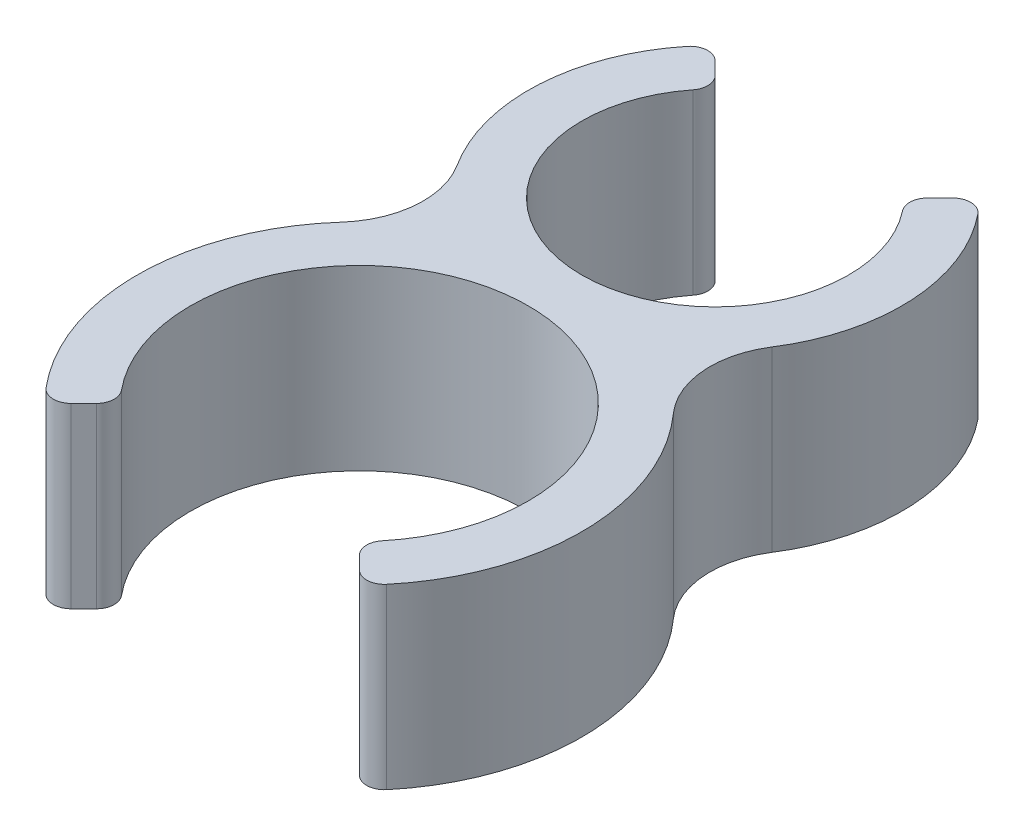
ISO-10303-21;
HEADER;
FILE_DESCRIPTION(('STEP AP214'),'2;1');
FILE_NAME('part.step','',(''),(''),'','','');
FILE_SCHEMA(('AUTOMOTIVE_DESIGN { 1 0 10303 214 1 1 1 1 }'));
ENDSEC;
DATA;
#1=APPLICATION_CONTEXT('core data for automotive mechanical design processes');
#2=APPLICATION_PROTOCOL_DEFINITION('international standard','automotive_design',2000,#1);
#3=PRODUCT_CONTEXT('',#1,'mechanical');
#4=PRODUCT('Part','Part','',(#3));
#5=PRODUCT_RELATED_PRODUCT_CATEGORY('part','',(#4));
#6=PRODUCT_DEFINITION_FORMATION('','',#4);
#7=PRODUCT_DEFINITION_CONTEXT('part definition',#1,'design');
#8=PRODUCT_DEFINITION('design','',#6,#7);
#9=PRODUCT_DEFINITION_SHAPE('','',#8);
#10=(LENGTH_UNIT() NAMED_UNIT(*) SI_UNIT(.MILLI.,.METRE.));
#11=(NAMED_UNIT(*) PLANE_ANGLE_UNIT() SI_UNIT($,.RADIAN.));
#12=(NAMED_UNIT(*) SI_UNIT($,.STERADIAN.) SOLID_ANGLE_UNIT());
#13=UNCERTAINTY_MEASURE_WITH_UNIT(LENGTH_MEASURE(1.E-05),#10,'distance_accuracy_value','');
#14=(GEOMETRIC_REPRESENTATION_CONTEXT(3) GLOBAL_UNCERTAINTY_ASSIGNED_CONTEXT((#13)) GLOBAL_UNIT_ASSIGNED_CONTEXT((#10,
#11,#12)) REPRESENTATION_CONTEXT('',''));
#15=CARTESIAN_POINT('',(0.,0.,0.));
#16=DIRECTION('',(0.,0.,1.));
#17=DIRECTION('',(1.,0.,0.));
#18=AXIS2_PLACEMENT_3D('',#15,#16,#17);
#19=CARTESIAN_POINT('',(0.,10.,-10.));
#20=DIRECTION('',(0.,-1.,0.));
#21=DIRECTION('',(0.,0.,-1.));
#22=AXIS2_PLACEMENT_3D('',#19,#20,#21);
#23=CYLINDRICAL_SURFACE('',#22,7.5);
#24=CARTESIAN_POINT('',(0.,0.,-10.));
#25=DIRECTION('',(0.,-1.,0.));
#26=DIRECTION('',(0.,0.,1.));
#27=AXIS2_PLACEMENT_3D('',#24,#25,#26);
#28=CIRCLE('',#27,7.5);
#29=CARTESIAN_POINT('',(5.89038968324402,0.,-14.6425541870324));
#30=VERTEX_POINT('',#29);
#31=CARTESIAN_POINT('',(-5.89038968324402,0.,-14.6425541870324));
#32=VERTEX_POINT('',#31);
#33=EDGE_CURVE('E378',#30,#32,#28,.T.);
#34=ORIENTED_EDGE('',*,*,#33,.T.);
#35=DIRECTION('',(0.,-1.,0.));
#36=VECTOR('',#35,1.);
#37=CARTESIAN_POINT('',(-5.89038968324402,10.,-14.6425541870324));
#38=LINE('',#37,#36);
#39=CARTESIAN_POINT('',(-5.89038968324402,10.,-14.6425541870324));
#40=VERTEX_POINT('',#39);
#41=EDGE_CURVE('E262',#32,#40,#38,.F.);
#42=ORIENTED_EDGE('',*,*,#41,.T.);
#43=CARTESIAN_POINT('',(0.,10.,-10.));
#44=DIRECTION('',(0.,-1.,0.));
#45=DIRECTION('',(0.,0.,1.));
#46=AXIS2_PLACEMENT_3D('',#43,#44,#45);
#47=CIRCLE('',#46,7.5);
#48=CARTESIAN_POINT('',(5.89038968324402,10.,-14.6425541870324));
#49=VERTEX_POINT('',#48);
#50=EDGE_CURVE('E206',#49,#40,#47,.T.);
#51=ORIENTED_EDGE('',*,*,#50,.F.);
#52=DIRECTION('',(0.,-1.,0.));
#53=VECTOR('',#52,1.);
#54=CARTESIAN_POINT('',(5.89038968324402,10.,-14.6425541870324));
#55=LINE('',#54,#53);
#56=EDGE_CURVE('E259',#49,#30,#55,.T.);
#57=ORIENTED_EDGE('',*,*,#56,.T.);
#58=EDGE_LOOP('',(#34,#42,#51,#57));
#59=FACE_BOUND('',#58,.T.);
#60=ADVANCED_FACE('F33',(#59),#23,.F.);
#61=CARTESIAN_POINT('',(-5.30330085889912,10.,-15.3033008588991));
#62=DIRECTION('',(-0.707106781186546,0.,0.707106781186549));
#63=DIRECTION('',(0.707106781186549,0.,0.707106781186546));
#64=AXIS2_PLACEMENT_3D('',#61,#62,#63);
#65=PLANE('',#64);
#66=DIRECTION('',(-0.707106781186549,0.,-0.707106781186546));
#67=VECTOR('',#66,1.);
#68=CARTESIAN_POINT('',(-5.30330085889912,10.,-15.3033008588991));
#69=LINE('',#68,#67);
#70=CARTESIAN_POINT('',(-5.96866819315668,10.,-15.9686681931567));
#71=VERTEX_POINT('',#70);
#72=CARTESIAN_POINT('',(-6.68019460794371,10.,-16.6801946079437));
#73=VERTEX_POINT('',#72);
#74=EDGE_CURVE('E359',#71,#73,#69,.T.);
#75=ORIENTED_EDGE('',*,*,#74,.F.);
#76=DIRECTION('',(0.,-1.,0.));
#77=VECTOR('',#76,1.);
#78=CARTESIAN_POINT('',(-5.96866819315668,10.,-15.9686681931567));
#79=LINE('',#78,#77);
#80=CARTESIAN_POINT('',(-5.96866819315668,0.,-15.9686681931567));
#81=VERTEX_POINT('',#80);
#82=EDGE_CURVE('E256',#71,#81,#79,.T.);
#83=ORIENTED_EDGE('',*,*,#82,.T.);
#84=DIRECTION('',(-0.707106781186549,0.,-0.707106781186546));
#85=VECTOR('',#84,1.);
#86=CARTESIAN_POINT('',(-5.30330085889912,0.,-15.3033008588991));
#87=LINE('',#86,#85);
#88=CARTESIAN_POINT('',(-6.68019460794371,0.,-16.6801946079437));
#89=VERTEX_POINT('',#88);
#90=EDGE_CURVE('E380',#81,#89,#87,.T.);
#91=ORIENTED_EDGE('',*,*,#90,.T.);
#92=DIRECTION('',(0.,-1.,0.));
#93=VECTOR('',#92,1.);
#94=CARTESIAN_POINT('',(-6.68019460794371,10.,-16.6801946079437));
#95=LINE('',#94,#93);
#96=EDGE_CURVE('E254',#89,#73,#95,.F.);
#97=ORIENTED_EDGE('',*,*,#96,.T.);
#98=EDGE_LOOP('',(#75,#83,#91,#97));
#99=FACE_BOUND('',#98,.T.);
#100=ADVANCED_FACE('F311',(#99),#65,.F.);
#101=CARTESIAN_POINT('',(0.,10.,-10.));
#102=DIRECTION('',(0.,-1.,0.));
#103=DIRECTION('',(0.,0.,-1.));
#104=AXIS2_PLACEMENT_3D('',#101,#102,#103);
#105=CYLINDRICAL_SURFACE('',#104,10.5);
#106=CARTESIAN_POINT('',(0.,0.,-10.));
#107=DIRECTION('',(0.,1.,0.));
#108=DIRECTION('',(0.,0.,1.));
#109=AXIS2_PLACEMENT_3D('',#106,#107,#108);
#110=CIRCLE('',#109,10.5);
#111=CARTESIAN_POINT('',(-8.16491206167028,0.,-16.6018339137842));
#112=VERTEX_POINT('',#111);
#113=CARTESIAN_POINT('',(-8.84616047508096,0.,-4.34354838709677));
#114=VERTEX_POINT('',#113);
#115=EDGE_CURVE('E383',#112,#114,#110,.T.);
#116=ORIENTED_EDGE('',*,*,#115,.T.);
#117=DIRECTION('',(0.,-1.,0.));
#118=VECTOR('',#117,1.);
#119=CARTESIAN_POINT('',(-8.84616047508096,10.,-4.34354838709677));
#120=LINE('',#119,#118);
#121=CARTESIAN_POINT('',(-8.84616047508096,10.,-4.34354838709677));
#122=VERTEX_POINT('',#121);
#123=EDGE_CURVE('E54',#114,#122,#120,.F.);
#124=ORIENTED_EDGE('',*,*,#123,.T.);
#125=CARTESIAN_POINT('',(0.,10.,-10.));
#126=DIRECTION('',(0.,1.,0.));
#127=DIRECTION('',(0.,0.,1.));
#128=AXIS2_PLACEMENT_3D('',#125,#126,#127);
#129=CIRCLE('',#128,10.5);
#130=CARTESIAN_POINT('',(-8.16491206167028,10.,-16.6018339137842));
#131=VERTEX_POINT('',#130);
#132=EDGE_CURVE('E362',#131,#122,#129,.T.);
#133=ORIENTED_EDGE('',*,*,#132,.F.);
#134=DIRECTION('',(0.,-1.,0.));
#135=VECTOR('',#134,1.);
#136=CARTESIAN_POINT('',(-8.16491206167028,10.,-16.6018339137842));
#137=LINE('',#136,#135);
#138=EDGE_CURVE('E272',#131,#112,#137,.T.);
#139=ORIENTED_EDGE('',*,*,#138,.T.);
#140=EDGE_LOOP('',(#116,#124,#133,#139));
#141=FACE_BOUND('',#140,.T.);
#142=ADVANCED_FACE('F317',(#141),#105,.T.);
#143=CARTESIAN_POINT('',(0.,10.,10.));
#144=DIRECTION('',(0.,-1.,0.));
#145=DIRECTION('',(0.,0.,-1.));
#146=AXIS2_PLACEMENT_3D('',#143,#144,#145);
#147=CYLINDRICAL_SURFACE('',#146,12.5);
#148=CARTESIAN_POINT('',(0.,10.,10.));
#149=DIRECTION('',(0.,1.,0.));
#150=DIRECTION('',(0.,0.,1.));
#151=AXIS2_PLACEMENT_3D('',#148,#149,#150);
#152=CIRCLE('',#151,12.5);
#153=CARTESIAN_POINT('',(-9.32758417440509,10.,1.67857142857143));
#154=VERTEX_POINT('',#153);
#155=CARTESIAN_POINT('',(-9.57394853716998,10.,18.0367598824166));
#156=VERTEX_POINT('',#155);
#157=EDGE_CURVE('E366',#154,#156,#152,.T.);
#158=ORIENTED_EDGE('',*,*,#157,.F.);
#159=DIRECTION('',(0.,-1.,0.));
#160=VECTOR('',#159,1.);
#161=CARTESIAN_POINT('',(-9.32758417440509,10.,1.67857142857143));
#162=LINE('',#161,#160);
#163=CARTESIAN_POINT('',(-9.32758417440509,0.,1.67857142857143));
#164=VERTEX_POINT('',#163);
#165=EDGE_CURVE('E280',#154,#164,#162,.T.);
#166=ORIENTED_EDGE('',*,*,#165,.T.);
#167=CARTESIAN_POINT('',(0.,0.,10.));
#168=DIRECTION('',(0.,1.,0.));
#169=DIRECTION('',(0.,0.,1.));
#170=AXIS2_PLACEMENT_3D('',#167,#168,#169);
#171=CIRCLE('',#170,12.5);
#172=CARTESIAN_POINT('',(-9.57394853716998,0.,18.0367598824166));
#173=VERTEX_POINT('',#172);
#174=EDGE_CURVE('E385',#164,#173,#171,.T.);
#175=ORIENTED_EDGE('',*,*,#174,.T.);
#176=DIRECTION('',(0.,-1.,0.));
#177=VECTOR('',#176,1.);
#178=CARTESIAN_POINT('',(-9.57394853716998,10.,18.0367598824166));
#179=LINE('',#178,#177);
#180=EDGE_CURVE('E251',#173,#156,#179,.F.);
#181=ORIENTED_EDGE('',*,*,#180,.T.);
#182=EDGE_LOOP('',(#158,#166,#175,#181));
#183=FACE_BOUND('',#182,.T.);
#184=ADVANCED_FACE('F414',(#183),#147,.T.);
#185=CARTESIAN_POINT('',(-6.71751442127221,10.,16.7175144212722));
#186=DIRECTION('',(-0.707106781186545,0.,-0.70710678118655));
#187=DIRECTION('',(-0.70710678118655,0.,0.707106781186545));
#188=AXIS2_PLACEMENT_3D('',#185,#186,#187);
#189=PLANE('',#188);
#190=DIRECTION('',(0.70710678118655,0.,-0.707106781186545));
#191=VECTOR('',#190,1.);
#192=CARTESIAN_POINT('',(-6.71751442127221,10.,16.7175144212722));
#193=LINE('',#192,#191);
#194=CARTESIAN_POINT('',(-8.10092587300984,10.,18.1009258730098));
#195=VERTEX_POINT('',#194);
#196=CARTESIAN_POINT('',(-7.39087274954725,10.,17.3908727495472));
#197=VERTEX_POINT('',#196);
#198=EDGE_CURVE('E368',#195,#197,#193,.T.);
#199=ORIENTED_EDGE('',*,*,#198,.F.);
#200=DIRECTION('',(0.,-1.,0.));
#201=VECTOR('',#200,1.);
#202=CARTESIAN_POINT('',(-8.10092587300984,10.,18.1009258730098));
#203=LINE('',#202,#201);
#204=CARTESIAN_POINT('',(-8.10092587300984,0.,18.1009258730098));
#205=VERTEX_POINT('',#204);
#206=EDGE_CURVE('E248',#195,#205,#203,.T.);
#207=ORIENTED_EDGE('',*,*,#206,.T.);
#208=DIRECTION('',(0.70710678118655,0.,-0.707106781186545));
#209=VECTOR('',#208,1.);
#210=CARTESIAN_POINT('',(-6.71751442127221,0.,16.7175144212722));
#211=LINE('',#210,#209);
#212=CARTESIAN_POINT('',(-7.39087274954725,0.,17.3908727495472));
#213=VERTEX_POINT('',#212);
#214=EDGE_CURVE('E387',#205,#213,#211,.T.);
#215=ORIENTED_EDGE('',*,*,#214,.T.);
#216=DIRECTION('',(0.,-1.,0.));
#217=VECTOR('',#216,1.);
#218=CARTESIAN_POINT('',(-7.39087274954725,10.,17.3908727495472));
#219=LINE('',#218,#217);
#220=EDGE_CURVE('E246',#213,#197,#219,.F.);
#221=ORIENTED_EDGE('',*,*,#220,.T.);
#222=EDGE_LOOP('',(#199,#207,#215,#221));
#223=FACE_BOUND('',#222,.T.);
#224=ADVANCED_FACE('F408',(#223),#189,.F.);
#225=CARTESIAN_POINT('',(0.,10.,10.));
#226=DIRECTION('',(0.,-1.,0.));
#227=DIRECTION('',(0.,0.,-1.));
#228=AXIS2_PLACEMENT_3D('',#225,#226,#227);
#229=CYLINDRICAL_SURFACE('',#228,9.5);
#230=CARTESIAN_POINT('',(0.,0.,10.));
#231=DIRECTION('',(0.,-1.,0.));
#232=DIRECTION('',(0.,0.,1.));
#233=AXIS2_PLACEMENT_3D('',#230,#231,#232);
#234=CIRCLE('',#233,9.5);
#235=CARTESIAN_POINT('',(-7.32674338494963,0.,16.0472168285168));
#236=VERTEX_POINT('',#235);
#237=CARTESIAN_POINT('',(7.32674338494963,0.,16.0472168285168));
#238=VERTEX_POINT('',#237);
#239=EDGE_CURVE('E201',#236,#238,#234,.T.);
#240=ORIENTED_EDGE('',*,*,#239,.T.);
#241=DIRECTION('',(0.,-1.,0.));
#242=VECTOR('',#241,1.);
#243=CARTESIAN_POINT('',(7.32674338494963,10.,16.0472168285168));
#244=LINE('',#243,#242);
#245=CARTESIAN_POINT('',(7.32674338494963,10.,16.0472168285168));
#246=VERTEX_POINT('',#245);
#247=EDGE_CURVE('E244',#238,#246,#244,.F.);
#248=ORIENTED_EDGE('',*,*,#247,.T.);
#249=CARTESIAN_POINT('',(0.,10.,10.));
#250=DIRECTION('',(0.,-1.,0.));
#251=DIRECTION('',(0.,0.,1.));
#252=AXIS2_PLACEMENT_3D('',#249,#250,#251);
#253=CIRCLE('',#252,9.5);
#254=CARTESIAN_POINT('',(-7.32674338494963,10.,16.0472168285168));
#255=VERTEX_POINT('',#254);
#256=EDGE_CURVE('E371',#255,#246,#253,.T.);
#257=ORIENTED_EDGE('',*,*,#256,.F.);
#258=DIRECTION('',(0.,-1.,0.));
#259=VECTOR('',#258,1.);
#260=CARTESIAN_POINT('',(-7.32674338494963,10.,16.0472168285168));
#261=LINE('',#260,#259);
#262=EDGE_CURVE('E241',#255,#236,#261,.T.);
#263=ORIENTED_EDGE('',*,*,#262,.T.);
#264=EDGE_LOOP('',(#240,#248,#257,#263));
#265=FACE_BOUND('',#264,.T.);
#266=ADVANCED_FACE('F393',(#265),#229,.F.);
#267=CARTESIAN_POINT('',(6.71751442127221,10.,16.7175144212722));
#268=DIRECTION('',(0.707106781186545,0.,-0.70710678118655));
#269=DIRECTION('',(-0.70710678118655,0.,-0.707106781186545));
#270=AXIS2_PLACEMENT_3D('',#267,#268,#269);
#271=PLANE('',#270);
#272=DIRECTION('',(0.70710678118655,0.,0.707106781186545));
#273=VECTOR('',#272,1.);
#274=CARTESIAN_POINT('',(6.71751442127221,0.,16.7175144212722));
#275=LINE('',#274,#273);
#276=CARTESIAN_POINT('',(7.39087274954725,0.,17.3908727495472));
#277=VERTEX_POINT('',#276);
#278=CARTESIAN_POINT('',(8.10092587300984,0.,18.1009258730098));
#279=VERTEX_POINT('',#278);
#280=EDGE_CURVE('E197',#277,#279,#275,.T.);
#281=ORIENTED_EDGE('',*,*,#280,.T.);
#282=DIRECTION('',(0.,-1.,0.));
#283=VECTOR('',#282,1.);
#284=CARTESIAN_POINT('',(8.10092587300984,10.,18.1009258730098));
#285=LINE('',#284,#283);
#286=CARTESIAN_POINT('',(8.10092587300984,10.,18.1009258730098));
#287=VERTEX_POINT('',#286);
#288=EDGE_CURVE('E175',#279,#287,#285,.F.);
#289=ORIENTED_EDGE('',*,*,#288,.T.);
#290=DIRECTION('',(0.70710678118655,0.,0.707106781186545));
#291=VECTOR('',#290,1.);
#292=CARTESIAN_POINT('',(6.71751442127221,10.,16.7175144212722));
#293=LINE('',#292,#291);
#294=CARTESIAN_POINT('',(7.39087274954725,10.,17.3908727495472));
#295=VERTEX_POINT('',#294);
#296=EDGE_CURVE('E374',#295,#287,#293,.T.);
#297=ORIENTED_EDGE('',*,*,#296,.F.);
#298=DIRECTION('',(0.,-1.,0.));
#299=VECTOR('',#298,1.);
#300=CARTESIAN_POINT('',(7.39087274954725,10.,17.3908727495472));
#301=LINE('',#300,#299);
#302=EDGE_CURVE('E179',#295,#277,#301,.T.);
#303=ORIENTED_EDGE('',*,*,#302,.T.);
#304=EDGE_LOOP('',(#281,#289,#297,#303));
#305=FACE_BOUND('',#304,.T.);
#306=ADVANCED_FACE('F400',(#305),#271,.F.);
#307=CARTESIAN_POINT('',(0.,10.,10.));
#308=DIRECTION('',(0.,-1.,0.));
#309=DIRECTION('',(0.,0.,-1.));
#310=AXIS2_PLACEMENT_3D('',#307,#308,#309);
#311=CYLINDRICAL_SURFACE('',#310,12.5);
#312=CARTESIAN_POINT('',(0.,0.,10.));
#313=DIRECTION('',(0.,1.,0.));
#314=DIRECTION('',(0.,0.,1.));
#315=AXIS2_PLACEMENT_3D('',#312,#313,#314);
#316=CIRCLE('',#315,12.5);
#317=CARTESIAN_POINT('',(9.57394853716998,0.,18.0367598824166));
#318=VERTEX_POINT('',#317);
#319=CARTESIAN_POINT('',(9.32758417440509,0.,1.67857142857143));
#320=VERTEX_POINT('',#319);
#321=EDGE_CURVE('E186',#318,#320,#316,.T.);
#322=ORIENTED_EDGE('',*,*,#321,.T.);
#323=DIRECTION('',(0.,-1.,0.));
#324=VECTOR('',#323,1.);
#325=CARTESIAN_POINT('',(9.32758417440509,10.,1.67857142857143));
#326=LINE('',#325,#324);
#327=CARTESIAN_POINT('',(9.32758417440509,10.,1.67857142857143));
#328=VERTEX_POINT('',#327);
#329=EDGE_CURVE('E278',#320,#328,#326,.F.);
#330=ORIENTED_EDGE('',*,*,#329,.T.);
#331=CARTESIAN_POINT('',(0.,10.,10.));
#332=DIRECTION('',(0.,1.,0.));
#333=DIRECTION('',(0.,0.,1.));
#334=AXIS2_PLACEMENT_3D('',#331,#332,#333);
#335=CIRCLE('',#334,12.5);
#336=CARTESIAN_POINT('',(9.57394853716998,10.,18.0367598824166));
#337=VERTEX_POINT('',#336);
#338=EDGE_CURVE('E189',#337,#328,#335,.T.);
#339=ORIENTED_EDGE('',*,*,#338,.F.);
#340=DIRECTION('',(0.,-1.,0.));
#341=VECTOR('',#340,1.);
#342=CARTESIAN_POINT('',(9.57394853716998,10.,18.0367598824166));
#343=LINE('',#342,#341);
#344=EDGE_CURVE('E174',#337,#318,#343,.T.);
#345=ORIENTED_EDGE('',*,*,#344,.T.);
#346=EDGE_LOOP('',(#322,#330,#339,#345));
#347=FACE_BOUND('',#346,.T.);
#348=ADVANCED_FACE('F185',(#347),#311,.T.);
#349=CARTESIAN_POINT('',(0.,10.,-10.));
#350=DIRECTION('',(0.,-1.,0.));
#351=DIRECTION('',(0.,0.,-1.));
#352=AXIS2_PLACEMENT_3D('',#349,#350,#351);
#353=CYLINDRICAL_SURFACE('',#352,10.5);
#354=CARTESIAN_POINT('',(0.,10.,-10.));
#355=DIRECTION('',(0.,1.,0.));
#356=DIRECTION('',(0.,0.,1.));
#357=AXIS2_PLACEMENT_3D('',#354,#355,#356);
#358=CIRCLE('',#357,10.5);
#359=CARTESIAN_POINT('',(8.84616047508095,10.,-4.34354838709678));
#360=VERTEX_POINT('',#359);
#361=CARTESIAN_POINT('',(8.16491206167028,10.,-16.6018339137842));
#362=VERTEX_POINT('',#361);
#363=EDGE_CURVE('E291',#360,#362,#358,.T.);
#364=ORIENTED_EDGE('',*,*,#363,.F.);
#365=DIRECTION('',(0.,-1.,0.));
#366=VECTOR('',#365,1.);
#367=CARTESIAN_POINT('',(8.84616047508095,10.,-4.34354838709678));
#368=LINE('',#367,#366);
#369=CARTESIAN_POINT('',(8.84616047508095,0.,-4.34354838709678));
#370=VERTEX_POINT('',#369);
#371=EDGE_CURVE('E275',#360,#370,#368,.T.);
#372=ORIENTED_EDGE('',*,*,#371,.T.);
#373=CARTESIAN_POINT('',(0.,0.,-10.));
#374=DIRECTION('',(0.,1.,0.));
#375=DIRECTION('',(0.,0.,1.));
#376=AXIS2_PLACEMENT_3D('',#373,#374,#375);
#377=CIRCLE('',#376,10.5);
#378=CARTESIAN_POINT('',(8.16491206167028,0.,-16.6018339137842));
#379=VERTEX_POINT('',#378);
#380=EDGE_CURVE('E196',#370,#379,#377,.T.);
#381=ORIENTED_EDGE('',*,*,#380,.T.);
#382=DIRECTION('',(0.,-1.,0.));
#383=VECTOR('',#382,1.);
#384=CARTESIAN_POINT('',(8.16491206167028,10.,-16.6018339137842));
#385=LINE('',#384,#383);
#386=EDGE_CURVE('E269',#379,#362,#385,.F.);
#387=ORIENTED_EDGE('',*,*,#386,.T.);
#388=EDGE_LOOP('',(#364,#372,#381,#387));
#389=FACE_BOUND('',#388,.T.);
#390=ADVANCED_FACE('F295',(#389),#353,.T.);
#391=CARTESIAN_POINT('',(5.30330085889912,10.,-15.3033008588991));
#392=DIRECTION('',(0.707106781186546,0.,0.707106781186549));
#393=DIRECTION('',(0.707106781186549,0.,-0.707106781186546));
#394=AXIS2_PLACEMENT_3D('',#391,#392,#393);
#395=PLANE('',#394);
#396=DIRECTION('',(-0.707106781186549,0.,0.707106781186546));
#397=VECTOR('',#396,1.);
#398=CARTESIAN_POINT('',(5.30330085889912,10.,-15.3033008588991));
#399=LINE('',#398,#397);
#400=CARTESIAN_POINT('',(6.68019460794371,10.,-16.6801946079437));
#401=VERTEX_POINT('',#400);
#402=CARTESIAN_POINT('',(5.96866819315668,10.,-15.9686681931567));
#403=VERTEX_POINT('',#402);
#404=EDGE_CURVE('E191',#401,#403,#399,.T.);
#405=ORIENTED_EDGE('',*,*,#404,.F.);
#406=DIRECTION('',(0.,-1.,0.));
#407=VECTOR('',#406,1.);
#408=CARTESIAN_POINT('',(6.68019460794371,10.,-16.6801946079437));
#409=LINE('',#408,#407);
#410=CARTESIAN_POINT('',(6.68019460794371,0.,-16.6801946079437));
#411=VERTEX_POINT('',#410);
#412=EDGE_CURVE('E266',#401,#411,#409,.T.);
#413=ORIENTED_EDGE('',*,*,#412,.T.);
#414=DIRECTION('',(-0.707106781186549,0.,0.707106781186546));
#415=VECTOR('',#414,1.);
#416=CARTESIAN_POINT('',(5.30330085889912,0.,-15.3033008588991));
#417=LINE('',#416,#415);
#418=CARTESIAN_POINT('',(5.96866819315668,0.,-15.9686681931567));
#419=VERTEX_POINT('',#418);
#420=EDGE_CURVE('E199',#411,#419,#417,.T.);
#421=ORIENTED_EDGE('',*,*,#420,.T.);
#422=DIRECTION('',(0.,-1.,0.));
#423=VECTOR('',#422,1.);
#424=CARTESIAN_POINT('',(5.96866819315668,10.,-15.9686681931567));
#425=LINE('',#424,#423);
#426=EDGE_CURVE('E264',#419,#403,#425,.F.);
#427=ORIENTED_EDGE('',*,*,#426,.T.);
#428=EDGE_LOOP('',(#405,#413,#421,#427));
#429=FACE_BOUND('',#428,.T.);
#430=ADVANCED_FACE('F439',(#429),#395,.F.);
#431=CARTESIAN_POINT('',(0.,10.,-10.));
#432=DIRECTION('',(0.,1.,0.));
#433=DIRECTION('',(0.,0.,1.));
#434=AXIS2_PLACEMENT_3D('',#431,#432,#433);
#435=PLANE('',#434);
#436=ORIENTED_EDGE('',*,*,#296,.T.);
#437=CARTESIAN_POINT('',(8.80803265419638,10.,17.3938190918233));
#438=DIRECTION('',(0.,1.,0.));
#439=DIRECTION('',(0.,0.,1.));
#440=AXIS2_PLACEMENT_3D('',#437,#438,#439);
#441=CIRCLE('',#440,1.);
#442=EDGE_CURVE('E239',#287,#337,#441,.T.);
#443=ORIENTED_EDGE('',*,*,#442,.T.);
#444=ORIENTED_EDGE('',*,*,#338,.T.);
#445=CARTESIAN_POINT('',(13.0586178441671,10.,-1.65));
#446=DIRECTION('',(0.,1.,0.));
#447=DIRECTION('',(0.,0.,1.));
#448=AXIS2_PLACEMENT_3D('',#445,#446,#447);
#449=CIRCLE('',#448,5.);
#450=EDGE_CURVE('E285',#328,#360,#449,.F.);
#451=ORIENTED_EDGE('',*,*,#450,.T.);
#452=ORIENTED_EDGE('',*,*,#363,.T.);
#453=CARTESIAN_POINT('',(7.38730138913025,10.,-15.9730878267571));
#454=DIRECTION('',(0.,1.,0.));
#455=DIRECTION('',(0.,0.,1.));
#456=AXIS2_PLACEMENT_3D('',#453,#454,#455);
#457=CIRCLE('',#456,1.);
#458=EDGE_CURVE('E229',#362,#401,#457,.T.);
#459=ORIENTED_EDGE('',*,*,#458,.T.);
#460=ORIENTED_EDGE('',*,*,#404,.T.);
#461=CARTESIAN_POINT('',(6.67577497434322,10.,-15.2615614119701));
#462=DIRECTION('',(0.,1.,0.));
#463=DIRECTION('',(0.,0.,1.));
#464=AXIS2_PLACEMENT_3D('',#461,#462,#463);
#465=CIRCLE('',#464,1.);
#466=EDGE_CURVE('E227',#403,#49,#465,.T.);
#467=ORIENTED_EDGE('',*,*,#466,.T.);
#468=ORIENTED_EDGE('',*,*,#50,.T.);
#469=CARTESIAN_POINT('',(-6.67577497434322,10.,-15.2615614119701));
#470=DIRECTION('',(0.,1.,0.));
#471=DIRECTION('',(0.,0.,1.));
#472=AXIS2_PLACEMENT_3D('',#469,#470,#471);
#473=CIRCLE('',#472,1.);
#474=EDGE_CURVE('E231',#40,#71,#473,.T.);
#475=ORIENTED_EDGE('',*,*,#474,.T.);
#476=ORIENTED_EDGE('',*,*,#74,.T.);
#477=CARTESIAN_POINT('',(-7.38730138913025,10.,-15.9730878267571));
#478=DIRECTION('',(0.,1.,0.));
#479=DIRECTION('',(0.,0.,1.));
#480=AXIS2_PLACEMENT_3D('',#477,#478,#479);
#481=CIRCLE('',#480,1.);
#482=EDGE_CURVE('E225',#73,#131,#481,.T.);
#483=ORIENTED_EDGE('',*,*,#482,.T.);
#484=ORIENTED_EDGE('',*,*,#132,.T.);
#485=CARTESIAN_POINT('',(-13.0586178441671,10.,-1.65));
#486=DIRECTION('',(0.,1.,0.));
#487=DIRECTION('',(0.,0.,1.));
#488=AXIS2_PLACEMENT_3D('',#485,#486,#487);
#489=CIRCLE('',#488,5.);
#490=EDGE_CURVE('E11',#122,#154,#489,.F.);
#491=ORIENTED_EDGE('',*,*,#490,.T.);
#492=ORIENTED_EDGE('',*,*,#157,.T.);
#493=CARTESIAN_POINT('',(-8.80803265419638,10.,17.3938190918233));
#494=DIRECTION('',(0.,1.,0.));
#495=DIRECTION('',(0.,0.,1.));
#496=AXIS2_PLACEMENT_3D('',#493,#494,#495);
#497=CIRCLE('',#496,1.);
#498=EDGE_CURVE('E235',#156,#195,#497,.T.);
#499=ORIENTED_EDGE('',*,*,#498,.T.);
#500=ORIENTED_EDGE('',*,*,#198,.T.);
#501=CARTESIAN_POINT('',(-8.0979795307338,10.,16.6837659683607));
#502=DIRECTION('',(0.,1.,0.));
#503=DIRECTION('',(0.,0.,1.));
#504=AXIS2_PLACEMENT_3D('',#501,#502,#503);
#505=CIRCLE('',#504,1.);
#506=EDGE_CURVE('E233',#197,#255,#505,.T.);
#507=ORIENTED_EDGE('',*,*,#506,.T.);
#508=ORIENTED_EDGE('',*,*,#256,.T.);
#509=CARTESIAN_POINT('',(8.0979795307338,10.,16.6837659683607));
#510=DIRECTION('',(0.,1.,0.));
#511=DIRECTION('',(0.,0.,1.));
#512=AXIS2_PLACEMENT_3D('',#509,#510,#511);
#513=CIRCLE('',#512,1.);
#514=EDGE_CURVE('E237',#246,#295,#513,.T.);
#515=ORIENTED_EDGE('',*,*,#514,.T.);
#516=EDGE_LOOP('',(#436,#443,#444,#451,#452,#459,#460,#467,#468,#475,#476,#483,#484,#491,#492,
#499,#500,#507,#508,#515));
#517=FACE_BOUND('',#516,.T.);
#518=ADVANCED_FACE('F290',(#517),#435,.T.);
#519=CARTESIAN_POINT('',(0.,0.,-10.));
#520=DIRECTION('',(0.,1.,0.));
#521=DIRECTION('',(0.,0.,1.));
#522=AXIS2_PLACEMENT_3D('',#519,#520,#521);
#523=PLANE('',#522);
#524=ORIENTED_EDGE('',*,*,#321,.F.);
#525=CARTESIAN_POINT('',(8.80803265419638,0.,17.3938190918233));
#526=DIRECTION('',(0.,1.,0.));
#527=DIRECTION('',(0.,0.,1.));
#528=AXIS2_PLACEMENT_3D('',#525,#526,#527);
#529=CIRCLE('',#528,1.);
#530=EDGE_CURVE('E170',#318,#279,#529,.F.);
#531=ORIENTED_EDGE('',*,*,#530,.T.);
#532=ORIENTED_EDGE('',*,*,#280,.F.);
#533=CARTESIAN_POINT('',(8.0979795307338,0.,16.6837659683607));
#534=DIRECTION('',(0.,1.,0.));
#535=DIRECTION('',(0.,0.,1.));
#536=AXIS2_PLACEMENT_3D('',#533,#534,#535);
#537=CIRCLE('',#536,1.);
#538=EDGE_CURVE('E180',#277,#238,#537,.F.);
#539=ORIENTED_EDGE('',*,*,#538,.T.);
#540=ORIENTED_EDGE('',*,*,#239,.F.);
#541=CARTESIAN_POINT('',(-8.0979795307338,0.,16.6837659683607));
#542=DIRECTION('',(0.,1.,0.));
#543=DIRECTION('',(0.,0.,1.));
#544=AXIS2_PLACEMENT_3D('',#541,#542,#543);
#545=CIRCLE('',#544,1.);
#546=EDGE_CURVE('E216',#236,#213,#545,.F.);
#547=ORIENTED_EDGE('',*,*,#546,.T.);
#548=ORIENTED_EDGE('',*,*,#214,.F.);
#549=CARTESIAN_POINT('',(-8.80803265419638,0.,17.3938190918233));
#550=DIRECTION('',(0.,1.,0.));
#551=DIRECTION('',(0.,0.,1.));
#552=AXIS2_PLACEMENT_3D('',#549,#550,#551);
#553=CIRCLE('',#552,1.);
#554=EDGE_CURVE('E218',#205,#173,#553,.F.);
#555=ORIENTED_EDGE('',*,*,#554,.T.);
#556=ORIENTED_EDGE('',*,*,#174,.F.);
#557=CARTESIAN_POINT('',(-13.0586178441671,0.,-1.65));
#558=DIRECTION('',(0.,1.,0.));
#559=DIRECTION('',(0.,0.,1.));
#560=AXIS2_PLACEMENT_3D('',#557,#558,#559);
#561=CIRCLE('',#560,5.);
#562=EDGE_CURVE('E41',#164,#114,#561,.T.);
#563=ORIENTED_EDGE('',*,*,#562,.T.);
#564=ORIENTED_EDGE('',*,*,#115,.F.);
#565=CARTESIAN_POINT('',(-7.38730138913025,0.,-15.9730878267571));
#566=DIRECTION('',(0.,1.,0.));
#567=DIRECTION('',(0.,0.,1.));
#568=AXIS2_PLACEMENT_3D('',#565,#566,#567);
#569=CIRCLE('',#568,1.);
#570=EDGE_CURVE('E190',#112,#89,#569,.F.);
#571=ORIENTED_EDGE('',*,*,#570,.T.);
#572=ORIENTED_EDGE('',*,*,#90,.F.);
#573=CARTESIAN_POINT('',(-6.67577497434322,0.,-15.2615614119701));
#574=DIRECTION('',(0.,1.,0.));
#575=DIRECTION('',(0.,0.,1.));
#576=AXIS2_PLACEMENT_3D('',#573,#574,#575);
#577=CIRCLE('',#576,1.);
#578=EDGE_CURVE('E214',#81,#32,#577,.F.);
#579=ORIENTED_EDGE('',*,*,#578,.T.);
#580=ORIENTED_EDGE('',*,*,#33,.F.);
#581=CARTESIAN_POINT('',(6.67577497434322,0.,-15.2615614119701));
#582=DIRECTION('',(0.,1.,0.));
#583=DIRECTION('',(0.,0.,1.));
#584=AXIS2_PLACEMENT_3D('',#581,#582,#583);
#585=CIRCLE('',#584,1.);
#586=EDGE_CURVE('E209',#30,#419,#585,.F.);
#587=ORIENTED_EDGE('',*,*,#586,.T.);
#588=ORIENTED_EDGE('',*,*,#420,.F.);
#589=CARTESIAN_POINT('',(7.38730138913025,0.,-15.9730878267571));
#590=DIRECTION('',(0.,1.,0.));
#591=DIRECTION('',(0.,0.,1.));
#592=AXIS2_PLACEMENT_3D('',#589,#590,#591);
#593=CIRCLE('',#592,1.);
#594=EDGE_CURVE('E211',#411,#379,#593,.F.);
#595=ORIENTED_EDGE('',*,*,#594,.T.);
#596=ORIENTED_EDGE('',*,*,#380,.F.);
#597=CARTESIAN_POINT('',(13.0586178441671,0.,-1.65));
#598=DIRECTION('',(0.,1.,0.));
#599=DIRECTION('',(0.,0.,1.));
#600=AXIS2_PLACEMENT_3D('',#597,#598,#599);
#601=CIRCLE('',#600,5.);
#602=EDGE_CURVE('E195',#370,#320,#601,.T.);
#603=ORIENTED_EDGE('',*,*,#602,.T.);
#604=EDGE_LOOP('',(#524,#531,#532,#539,#540,#547,#548,#555,#556,#563,#564,#571,#572,#579,#580,
#587,#588,#595,#596,#603));
#605=FACE_BOUND('',#604,.T.);
#606=ADVANCED_FACE('F193',(#605),#523,.F.);
#607=CARTESIAN_POINT('',(8.80803265419638,10.,17.3938190918233));
#608=DIRECTION('',(0.,-1.,0.));
#609=DIRECTION('',(0.,0.,-1.));
#610=AXIS2_PLACEMENT_3D('',#607,#608,#609);
#611=CYLINDRICAL_SURFACE('',#610,1.);
#612=ORIENTED_EDGE('',*,*,#442,.F.);
#613=ORIENTED_EDGE('',*,*,#288,.F.);
#614=ORIENTED_EDGE('',*,*,#530,.F.);
#615=ORIENTED_EDGE('',*,*,#344,.F.);
#616=EDGE_LOOP('',(#612,#613,#614,#615));
#617=FACE_BOUND('',#616,.T.);
#618=ADVANCED_FACE('F173',(#617),#611,.T.);
#619=CARTESIAN_POINT('',(8.0979795307338,10.,16.6837659683607));
#620=DIRECTION('',(0.,-1.,0.));
#621=DIRECTION('',(0.,0.,-1.));
#622=AXIS2_PLACEMENT_3D('',#619,#620,#621);
#623=CYLINDRICAL_SURFACE('',#622,1.);
#624=ORIENTED_EDGE('',*,*,#514,.F.);
#625=ORIENTED_EDGE('',*,*,#247,.F.);
#626=ORIENTED_EDGE('',*,*,#538,.F.);
#627=ORIENTED_EDGE('',*,*,#302,.F.);
#628=EDGE_LOOP('',(#624,#625,#626,#627));
#629=FACE_BOUND('',#628,.T.);
#630=ADVANCED_FACE('F325',(#629),#623,.T.);
#631=CARTESIAN_POINT('',(-8.80803265419638,10.,17.3938190918233));
#632=DIRECTION('',(0.,-1.,0.));
#633=DIRECTION('',(0.,0.,-1.));
#634=AXIS2_PLACEMENT_3D('',#631,#632,#633);
#635=CYLINDRICAL_SURFACE('',#634,1.);
#636=ORIENTED_EDGE('',*,*,#498,.F.);
#637=ORIENTED_EDGE('',*,*,#180,.F.);
#638=ORIENTED_EDGE('',*,*,#554,.F.);
#639=ORIENTED_EDGE('',*,*,#206,.F.);
#640=EDGE_LOOP('',(#636,#637,#638,#639));
#641=FACE_BOUND('',#640,.T.);
#642=ADVANCED_FACE('F328',(#641),#635,.T.);
#643=CARTESIAN_POINT('',(-8.0979795307338,10.,16.6837659683607));
#644=DIRECTION('',(0.,-1.,0.));
#645=DIRECTION('',(0.,0.,-1.));
#646=AXIS2_PLACEMENT_3D('',#643,#644,#645);
#647=CYLINDRICAL_SURFACE('',#646,1.);
#648=ORIENTED_EDGE('',*,*,#506,.F.);
#649=ORIENTED_EDGE('',*,*,#220,.F.);
#650=ORIENTED_EDGE('',*,*,#546,.F.);
#651=ORIENTED_EDGE('',*,*,#262,.F.);
#652=EDGE_LOOP('',(#648,#649,#650,#651));
#653=FACE_BOUND('',#652,.T.);
#654=ADVANCED_FACE('F332',(#653),#647,.T.);
#655=CARTESIAN_POINT('',(-6.67577497434322,10.,-15.2615614119701));
#656=DIRECTION('',(0.,-1.,0.));
#657=DIRECTION('',(0.,0.,-1.));
#658=AXIS2_PLACEMENT_3D('',#655,#656,#657);
#659=CYLINDRICAL_SURFACE('',#658,1.);
#660=ORIENTED_EDGE('',*,*,#474,.F.);
#661=ORIENTED_EDGE('',*,*,#41,.F.);
#662=ORIENTED_EDGE('',*,*,#578,.F.);
#663=ORIENTED_EDGE('',*,*,#82,.F.);
#664=EDGE_LOOP('',(#660,#661,#662,#663));
#665=FACE_BOUND('',#664,.T.);
#666=ADVANCED_FACE('F336',(#665),#659,.T.);
#667=CARTESIAN_POINT('',(7.38730138913025,10.,-15.9730878267571));
#668=DIRECTION('',(0.,-1.,0.));
#669=DIRECTION('',(0.,0.,-1.));
#670=AXIS2_PLACEMENT_3D('',#667,#668,#669);
#671=CYLINDRICAL_SURFACE('',#670,1.);
#672=ORIENTED_EDGE('',*,*,#458,.F.);
#673=ORIENTED_EDGE('',*,*,#386,.F.);
#674=ORIENTED_EDGE('',*,*,#594,.F.);
#675=ORIENTED_EDGE('',*,*,#412,.F.);
#676=EDGE_LOOP('',(#672,#673,#674,#675));
#677=FACE_BOUND('',#676,.T.);
#678=ADVANCED_FACE('F340',(#677),#671,.T.);
#679=CARTESIAN_POINT('',(6.67577497434322,10.,-15.2615614119701));
#680=DIRECTION('',(0.,-1.,0.));
#681=DIRECTION('',(0.,0.,-1.));
#682=AXIS2_PLACEMENT_3D('',#679,#680,#681);
#683=CYLINDRICAL_SURFACE('',#682,1.);
#684=ORIENTED_EDGE('',*,*,#466,.F.);
#685=ORIENTED_EDGE('',*,*,#426,.F.);
#686=ORIENTED_EDGE('',*,*,#586,.F.);
#687=ORIENTED_EDGE('',*,*,#56,.F.);
#688=EDGE_LOOP('',(#684,#685,#686,#687));
#689=FACE_BOUND('',#688,.T.);
#690=ADVANCED_FACE('F307',(#689),#683,.T.);
#691=CARTESIAN_POINT('',(-7.38730138913025,10.,-15.9730878267571));
#692=DIRECTION('',(0.,-1.,0.));
#693=DIRECTION('',(0.,0.,-1.));
#694=AXIS2_PLACEMENT_3D('',#691,#692,#693);
#695=CYLINDRICAL_SURFACE('',#694,1.);
#696=ORIENTED_EDGE('',*,*,#482,.F.);
#697=ORIENTED_EDGE('',*,*,#96,.F.);
#698=ORIENTED_EDGE('',*,*,#570,.F.);
#699=ORIENTED_EDGE('',*,*,#138,.F.);
#700=EDGE_LOOP('',(#696,#697,#698,#699));
#701=FACE_BOUND('',#700,.T.);
#702=ADVANCED_FACE('F301',(#701),#695,.T.);
#703=CARTESIAN_POINT('',(13.0586178441671,10.,-1.65));
#704=DIRECTION('',(0.,1.,0.));
#705=DIRECTION('',(0.,0.,1.));
#706=AXIS2_PLACEMENT_3D('',#703,#704,#705);
#707=CYLINDRICAL_SURFACE('',#706,5.);
#708=ORIENTED_EDGE('',*,*,#450,.F.);
#709=ORIENTED_EDGE('',*,*,#329,.F.);
#710=ORIENTED_EDGE('',*,*,#602,.F.);
#711=ORIENTED_EDGE('',*,*,#371,.F.);
#712=EDGE_LOOP('',(#708,#709,#710,#711));
#713=FACE_BOUND('',#712,.T.);
#714=ADVANCED_FACE('F299',(#713),#707,.F.);
#715=CARTESIAN_POINT('',(-13.0586178441671,10.,-1.65));
#716=DIRECTION('',(0.,1.,0.));
#717=DIRECTION('',(0.,0.,1.));
#718=AXIS2_PLACEMENT_3D('',#715,#716,#717);
#719=CYLINDRICAL_SURFACE('',#718,5.);
#720=ORIENTED_EDGE('',*,*,#490,.F.);
#721=ORIENTED_EDGE('',*,*,#123,.F.);
#722=ORIENTED_EDGE('',*,*,#562,.F.);
#723=ORIENTED_EDGE('',*,*,#165,.F.);
#724=EDGE_LOOP('',(#720,#721,#722,#723));
#725=FACE_BOUND('',#724,.T.);
#726=ADVANCED_FACE('F35',(#725),#719,.F.);
#727=CLOSED_SHELL('',(#60,#100,#142,#184,#224,#266,#306,#348,#390,#430,#518,#606,#618,#630,#642,
#654,#666,#678,#690,#702,#714,#726));
#728=MANIFOLD_SOLID_BREP('B2',#727);
#729=ADVANCED_BREP_SHAPE_REPRESENTATION('',(#18,#728),#14);
#730=SHAPE_DEFINITION_REPRESENTATION(#9,#729);
ENDSEC;
END-ISO-10303-21;
